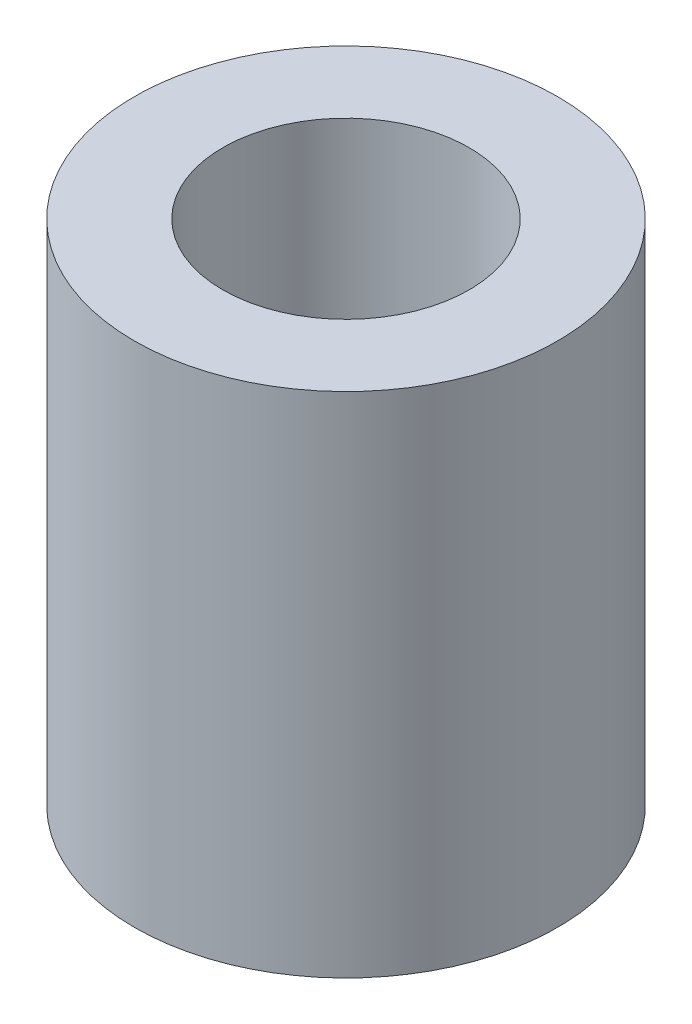
ISO-10303-21;
HEADER;
FILE_DESCRIPTION(('STEP AP214'),'2;1');
FILE_NAME('part.step','',(''),(''),'','','');
FILE_SCHEMA(('AUTOMOTIVE_DESIGN { 1 0 10303 214 1 1 1 1 }'));
ENDSEC;
DATA;
#1=APPLICATION_CONTEXT('core data for automotive mechanical design processes');
#2=APPLICATION_PROTOCOL_DEFINITION('international standard','automotive_design',2000,#1);
#3=PRODUCT_CONTEXT('',#1,'mechanical');
#4=PRODUCT('Part','Part','',(#3));
#5=PRODUCT_RELATED_PRODUCT_CATEGORY('part','',(#4));
#6=PRODUCT_DEFINITION_FORMATION('','',#4);
#7=PRODUCT_DEFINITION_CONTEXT('part definition',#1,'design');
#8=PRODUCT_DEFINITION('design','',#6,#7);
#9=PRODUCT_DEFINITION_SHAPE('','',#8);
#10=(LENGTH_UNIT() NAMED_UNIT(*) SI_UNIT(.MILLI.,.METRE.));
#11=(NAMED_UNIT(*) PLANE_ANGLE_UNIT() SI_UNIT($,.RADIAN.));
#12=(NAMED_UNIT(*) SI_UNIT($,.STERADIAN.) SOLID_ANGLE_UNIT());
#13=UNCERTAINTY_MEASURE_WITH_UNIT(LENGTH_MEASURE(1.E-05),#10,'distance_accuracy_value','');
#14=(GEOMETRIC_REPRESENTATION_CONTEXT(3) GLOBAL_UNCERTAINTY_ASSIGNED_CONTEXT((#13)) GLOBAL_UNIT_ASSIGNED_CONTEXT((#10,
#11,#12)) REPRESENTATION_CONTEXT('',''));
#15=CARTESIAN_POINT('',(0.,0.,0.));
#16=DIRECTION('',(0.,0.,1.));
#17=DIRECTION('',(1.,0.,0.));
#18=AXIS2_PLACEMENT_3D('',#15,#16,#17);
#19=CARTESIAN_POINT('',(0.,30.,0.));
#20=DIRECTION('',(0.,1.,0.));
#21=DIRECTION('',(0.,0.,1.));
#22=AXIS2_PLACEMENT_3D('',#19,#20,#21);
#23=PLANE('',#22);
#24=CARTESIAN_POINT('',(0.,30.,0.));
#25=DIRECTION('',(0.,1.,0.));
#26=DIRECTION('',(0.,0.,1.));
#27=AXIS2_PLACEMENT_3D('',#24,#25,#26);
#28=CIRCLE('',#27,12.5);
#29=CARTESIAN_POINT('',(0.,30.,12.5));
#30=VERTEX_POINT('',#29);
#31=EDGE_CURVE('E10',#30,#30,#28,.T.);
#32=ORIENTED_EDGE('',*,*,#31,.T.);
#33=EDGE_LOOP('',(#32));
#34=FACE_BOUND('',#33,.T.);
#35=CARTESIAN_POINT('',(0.,30.,0.));
#36=DIRECTION('',(0.,1.,0.));
#37=DIRECTION('',(0.,0.,1.));
#38=AXIS2_PLACEMENT_3D('',#35,#36,#37);
#39=CIRCLE('',#38,7.27754557097734);
#40=CARTESIAN_POINT('',(0.,30.,7.27754557097734));
#41=VERTEX_POINT('',#40);
#42=EDGE_CURVE('E42',#41,#41,#39,.T.);
#43=ORIENTED_EDGE('',*,*,#42,.F.);
#44=EDGE_LOOP('',(#43));
#45=FACE_BOUND('',#44,.T.);
#46=ADVANCED_FACE('F31',(#34,#45),#23,.T.);
#47=CARTESIAN_POINT('',(0.,0.,0.));
#48=DIRECTION('',(0.,1.,0.));
#49=DIRECTION('',(0.,0.,1.));
#50=AXIS2_PLACEMENT_3D('',#47,#48,#49);
#51=PLANE('',#50);
#52=CARTESIAN_POINT('',(0.,0.,0.));
#53=DIRECTION('',(0.,1.,0.));
#54=DIRECTION('',(0.,0.,1.));
#55=AXIS2_PLACEMENT_3D('',#52,#53,#54);
#56=CIRCLE('',#55,12.5);
#57=CARTESIAN_POINT('',(0.,0.,12.5));
#58=VERTEX_POINT('',#57);
#59=EDGE_CURVE('E35',#58,#58,#56,.T.);
#60=ORIENTED_EDGE('',*,*,#59,.F.);
#61=EDGE_LOOP('',(#60));
#62=FACE_BOUND('',#61,.T.);
#63=CARTESIAN_POINT('',(0.,0.,0.));
#64=DIRECTION('',(0.,1.,0.));
#65=DIRECTION('',(0.,0.,1.));
#66=AXIS2_PLACEMENT_3D('',#63,#64,#65);
#67=CIRCLE('',#66,7.27754557097734);
#68=CARTESIAN_POINT('',(0.,0.,7.27754557097734));
#69=VERTEX_POINT('',#68);
#70=EDGE_CURVE('E44',#69,#69,#67,.T.);
#71=ORIENTED_EDGE('',*,*,#70,.T.);
#72=EDGE_LOOP('',(#71));
#73=FACE_BOUND('',#72,.T.);
#74=ADVANCED_FACE('F54',(#62,#73),#51,.F.);
#75=CARTESIAN_POINT('',(0.,30.,0.));
#76=DIRECTION('',(0.,-1.,0.));
#77=DIRECTION('',(0.,0.,-1.));
#78=AXIS2_PLACEMENT_3D('',#75,#76,#77);
#79=CYLINDRICAL_SURFACE('',#78,12.5);
#80=ORIENTED_EDGE('',*,*,#31,.F.);
#81=EDGE_LOOP('',(#80));
#82=FACE_BOUND('',#81,.T.);
#83=ORIENTED_EDGE('',*,*,#59,.T.);
#84=EDGE_LOOP('',(#83));
#85=FACE_BOUND('',#84,.T.);
#86=ADVANCED_FACE('F33',(#82,#85),#79,.T.);
#87=CARTESIAN_POINT('',(0.,30.,0.));
#88=DIRECTION('',(0.,-1.,0.));
#89=DIRECTION('',(0.,0.,-1.));
#90=AXIS2_PLACEMENT_3D('',#87,#88,#89);
#91=CYLINDRICAL_SURFACE('',#90,7.27754557097734);
#92=ORIENTED_EDGE('',*,*,#42,.T.);
#93=EDGE_LOOP('',(#92));
#94=FACE_BOUND('',#93,.T.);
#95=ORIENTED_EDGE('',*,*,#70,.F.);
#96=EDGE_LOOP('',(#95));
#97=FACE_BOUND('',#96,.T.);
#98=ADVANCED_FACE('F50',(#94,#97),#91,.F.);
#99=CLOSED_SHELL('',(#46,#74,#86,#98));
#100=MANIFOLD_SOLID_BREP('B2',#99);
#101=ADVANCED_BREP_SHAPE_REPRESENTATION('',(#18,#100),#14);
#102=SHAPE_DEFINITION_REPRESENTATION(#9,#101);
ENDSEC;
END-ISO-10303-21;
